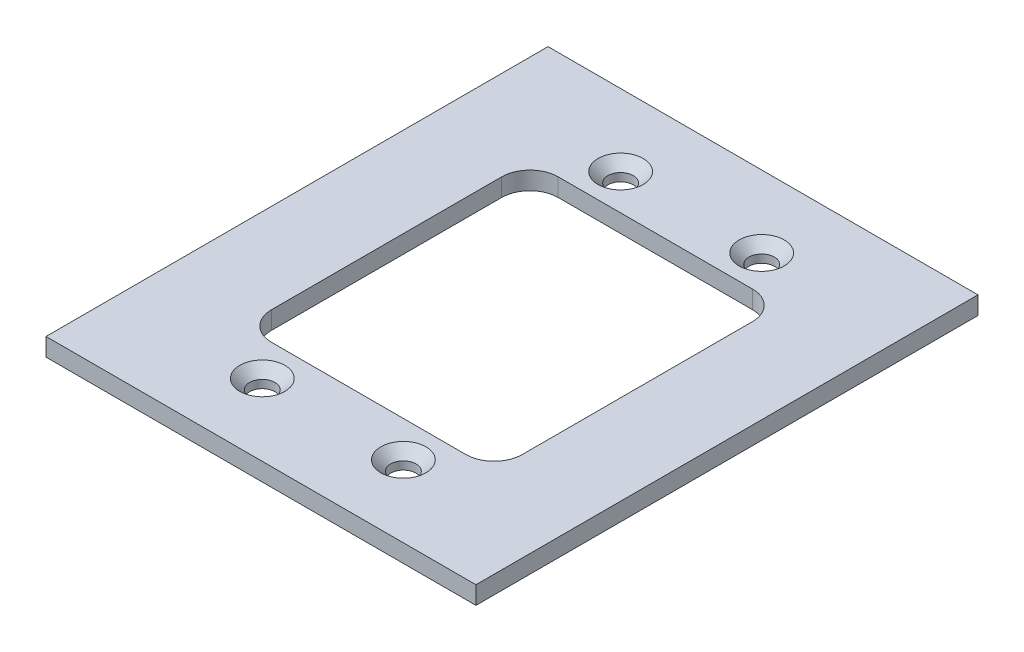
ISO-10303-21;
HEADER;
FILE_DESCRIPTION(('STEP AP214'),'2;1');
FILE_NAME('part.step','',(''),(''),'','','');
FILE_SCHEMA(('AUTOMOTIVE_DESIGN { 1 0 10303 214 1 1 1 1 }'));
ENDSEC;
DATA;
#1=APPLICATION_CONTEXT('core data for automotive mechanical design processes');
#2=APPLICATION_PROTOCOL_DEFINITION('international standard','automotive_design',2000,#1);
#3=PRODUCT_CONTEXT('',#1,'mechanical');
#4=PRODUCT('Part','Part','',(#3));
#5=PRODUCT_RELATED_PRODUCT_CATEGORY('part','',(#4));
#6=PRODUCT_DEFINITION_FORMATION('','',#4);
#7=PRODUCT_DEFINITION_CONTEXT('part definition',#1,'design');
#8=PRODUCT_DEFINITION('design','',#6,#7);
#9=PRODUCT_DEFINITION_SHAPE('','',#8);
#10=(LENGTH_UNIT() NAMED_UNIT(*) SI_UNIT(.MILLI.,.METRE.));
#11=(NAMED_UNIT(*) PLANE_ANGLE_UNIT() SI_UNIT($,.RADIAN.));
#12=(NAMED_UNIT(*) SI_UNIT($,.STERADIAN.) SOLID_ANGLE_UNIT());
#13=UNCERTAINTY_MEASURE_WITH_UNIT(LENGTH_MEASURE(1.E-05),#10,'distance_accuracy_value','');
#14=(GEOMETRIC_REPRESENTATION_CONTEXT(3) GLOBAL_UNCERTAINTY_ASSIGNED_CONTEXT((#13)) GLOBAL_UNIT_ASSIGNED_CONTEXT((#10,
#11,#12)) REPRESENTATION_CONTEXT('',''));
#15=CARTESIAN_POINT('',(0.,0.,0.));
#16=DIRECTION('',(0.,0.,1.));
#17=DIRECTION('',(1.,0.,0.));
#18=AXIS2_PLACEMENT_3D('',#15,#16,#17);
#19=CARTESIAN_POINT('',(0.,3.175,0.));
#20=DIRECTION('',(0.,1.,0.));
#21=DIRECTION('',(0.,0.,1.));
#22=AXIS2_PLACEMENT_3D('',#19,#20,#21);
#23=PLANE('',#22);
#24=CARTESIAN_POINT('',(-12.5,3.175,31.75));
#25=DIRECTION('',(0.,1.,0.));
#26=DIRECTION('',(0.,0.,1.));
#27=AXIS2_PLACEMENT_3D('',#24,#25,#26);
#28=CIRCLE('',#27,4.);
#29=CARTESIAN_POINT('',(-12.5,3.175,35.75));
#30=VERTEX_POINT('',#29);
#31=EDGE_CURVE('E318',#30,#30,#28,.T.);
#32=ORIENTED_EDGE('',*,*,#31,.F.);
#33=EDGE_LOOP('',(#32));
#34=FACE_BOUND('',#33,.T.);
#35=CARTESIAN_POINT('',(12.5,3.175,31.75));
#36=DIRECTION('',(0.,1.,0.));
#37=DIRECTION('',(0.,0.,1.));
#38=AXIS2_PLACEMENT_3D('',#35,#36,#37);
#39=CIRCLE('',#38,4.);
#40=CARTESIAN_POINT('',(12.5,3.175,35.75));
#41=VERTEX_POINT('',#40);
#42=EDGE_CURVE('E330',#41,#41,#39,.T.);
#43=ORIENTED_EDGE('',*,*,#42,.F.);
#44=EDGE_LOOP('',(#43));
#45=FACE_BOUND('',#44,.T.);
#46=CARTESIAN_POINT('',(-12.5,3.175,-31.75));
#47=DIRECTION('',(0.,1.,0.));
#48=DIRECTION('',(0.,0.,1.));
#49=AXIS2_PLACEMENT_3D('',#46,#47,#48);
#50=CIRCLE('',#49,4.);
#51=CARTESIAN_POINT('',(-12.5,3.175,-27.75));
#52=VERTEX_POINT('',#51);
#53=EDGE_CURVE('E339',#52,#52,#50,.T.);
#54=ORIENTED_EDGE('',*,*,#53,.F.);
#55=EDGE_LOOP('',(#54));
#56=FACE_BOUND('',#55,.T.);
#57=CARTESIAN_POINT('',(12.5,3.175,-31.75));
#58=DIRECTION('',(0.,1.,0.));
#59=DIRECTION('',(0.,0.,1.));
#60=AXIS2_PLACEMENT_3D('',#57,#58,#59);
#61=CIRCLE('',#60,4.);
#62=CARTESIAN_POINT('',(12.5,3.175,-27.75));
#63=VERTEX_POINT('',#62);
#64=EDGE_CURVE('E220',#63,#63,#61,.T.);
#65=ORIENTED_EDGE('',*,*,#64,.F.);
#66=EDGE_LOOP('',(#65));
#67=FACE_BOUND('',#66,.T.);
#68=DIRECTION('',(0.,0.,1.));
#69=VECTOR('',#68,1.);
#70=CARTESIAN_POINT('',(-38.1,3.175,-44.489));
#71=LINE('',#70,#69);
#72=CARTESIAN_POINT('',(-38.1,3.175,-44.489));
#73=VERTEX_POINT('',#72);
#74=CARTESIAN_POINT('',(-38.1,3.175,44.489));
#75=VERTEX_POINT('',#74);
#76=EDGE_CURVE('E139',#73,#75,#71,.T.);
#77=ORIENTED_EDGE('',*,*,#76,.T.);
#78=DIRECTION('',(1.,0.,0.));
#79=VECTOR('',#78,1.);
#80=CARTESIAN_POINT('',(-38.1,3.175,44.489));
#81=LINE('',#80,#79);
#82=CARTESIAN_POINT('',(38.1,3.175,44.489));
#83=VERTEX_POINT('',#82);
#84=EDGE_CURVE('E128',#75,#83,#81,.T.);
#85=ORIENTED_EDGE('',*,*,#84,.T.);
#86=DIRECTION('',(0.,0.,-1.));
#87=VECTOR('',#86,1.);
#88=CARTESIAN_POINT('',(38.1,3.175,-44.489));
#89=LINE('',#88,#87);
#90=CARTESIAN_POINT('',(38.1,3.175,-44.489));
#91=VERTEX_POINT('',#90);
#92=EDGE_CURVE('E138',#83,#91,#89,.T.);
#93=ORIENTED_EDGE('',*,*,#92,.T.);
#94=DIRECTION('',(-1.,0.,0.));
#95=VECTOR('',#94,1.);
#96=CARTESIAN_POINT('',(-38.1,3.175,-44.489));
#97=LINE('',#96,#95);
#98=EDGE_CURVE('E143',#91,#73,#97,.T.);
#99=ORIENTED_EDGE('',*,*,#98,.T.);
#100=EDGE_LOOP('',(#77,#85,#93,#99));
#101=FACE_BOUND('',#100,.T.);
#102=DIRECTION('',(1.,0.,0.));
#103=VECTOR('',#102,1.);
#104=CARTESIAN_POINT('',(-22.225,3.175,25.4));
#105=LINE('',#104,#103);
#106=CARTESIAN_POINT('',(-17.225,3.175,25.4));
#107=VERTEX_POINT('',#106);
#108=CARTESIAN_POINT('',(17.225,3.175,25.4));
#109=VERTEX_POINT('',#108);
#110=EDGE_CURVE('E209',#107,#109,#105,.T.);
#111=ORIENTED_EDGE('',*,*,#110,.F.);
#112=CARTESIAN_POINT('',(-17.225,3.175,20.4));
#113=DIRECTION('',(0.,1.,0.));
#114=DIRECTION('',(0.,0.,1.));
#115=AXIS2_PLACEMENT_3D('',#112,#113,#114);
#116=CIRCLE('',#115,5.);
#117=CARTESIAN_POINT('',(-22.225,3.175,20.4));
#118=VERTEX_POINT('',#117);
#119=EDGE_CURVE('E178',#107,#118,#116,.F.);
#120=ORIENTED_EDGE('',*,*,#119,.T.);
#121=DIRECTION('',(0.,0.,1.));
#122=VECTOR('',#121,1.);
#123=CARTESIAN_POINT('',(-22.225,3.175,-25.4));
#124=LINE('',#123,#122);
#125=CARTESIAN_POINT('',(-22.225,3.175,-20.4));
#126=VERTEX_POINT('',#125);
#127=EDGE_CURVE('E197',#126,#118,#124,.T.);
#128=ORIENTED_EDGE('',*,*,#127,.F.);
#129=CARTESIAN_POINT('',(-17.225,3.175,-20.4));
#130=DIRECTION('',(0.,1.,0.));
#131=DIRECTION('',(0.,0.,1.));
#132=AXIS2_PLACEMENT_3D('',#129,#130,#131);
#133=CIRCLE('',#132,5.);
#134=CARTESIAN_POINT('',(-17.225,3.175,-25.4));
#135=VERTEX_POINT('',#134);
#136=EDGE_CURVE('E53',#126,#135,#133,.F.);
#137=ORIENTED_EDGE('',*,*,#136,.T.);
#138=DIRECTION('',(-1.,0.,0.));
#139=VECTOR('',#138,1.);
#140=CARTESIAN_POINT('',(-22.225,3.175,-25.4));
#141=LINE('',#140,#139);
#142=CARTESIAN_POINT('',(17.225,3.175,-25.4));
#143=VERTEX_POINT('',#142);
#144=EDGE_CURVE('E205',#143,#135,#141,.T.);
#145=ORIENTED_EDGE('',*,*,#144,.F.);
#146=CARTESIAN_POINT('',(17.225,3.175,-20.4));
#147=DIRECTION('',(0.,1.,0.));
#148=DIRECTION('',(0.,0.,1.));
#149=AXIS2_PLACEMENT_3D('',#146,#147,#148);
#150=CIRCLE('',#149,5.);
#151=CARTESIAN_POINT('',(22.225,3.175,-20.4));
#152=VERTEX_POINT('',#151);
#153=EDGE_CURVE('E11',#143,#152,#150,.F.);
#154=ORIENTED_EDGE('',*,*,#153,.T.);
#155=DIRECTION('',(0.,0.,-1.));
#156=VECTOR('',#155,1.);
#157=CARTESIAN_POINT('',(22.225,3.175,-25.4));
#158=LINE('',#157,#156);
#159=CARTESIAN_POINT('',(22.225,3.175,20.4));
#160=VERTEX_POINT('',#159);
#161=EDGE_CURVE('E203',#160,#152,#158,.T.);
#162=ORIENTED_EDGE('',*,*,#161,.F.);
#163=CARTESIAN_POINT('',(17.225,3.175,20.4));
#164=DIRECTION('',(0.,1.,0.));
#165=DIRECTION('',(0.,0.,1.));
#166=AXIS2_PLACEMENT_3D('',#163,#164,#165);
#167=CIRCLE('',#166,5.);
#168=EDGE_CURVE('E182',#160,#109,#167,.F.);
#169=ORIENTED_EDGE('',*,*,#168,.T.);
#170=EDGE_LOOP('',(#111,#120,#128,#137,#145,#154,#162,#169));
#171=FACE_BOUND('',#170,.T.);
#172=ADVANCED_FACE('F38',(#34,#45,#56,#67,#101,#171),#23,.T.);
#173=CARTESIAN_POINT('',(0.,0.,0.));
#174=DIRECTION('',(0.,1.,0.));
#175=DIRECTION('',(0.,0.,1.));
#176=AXIS2_PLACEMENT_3D('',#173,#174,#175);
#177=PLANE('',#176);
#178=CARTESIAN_POINT('',(-12.5,0.,31.75));
#179=DIRECTION('',(0.,1.,0.));
#180=DIRECTION('',(0.,0.,1.));
#181=AXIS2_PLACEMENT_3D('',#178,#179,#180);
#182=CIRCLE('',#181,2.25);
#183=CARTESIAN_POINT('',(-12.5,0.,34.));
#184=VERTEX_POINT('',#183);
#185=EDGE_CURVE('E314',#184,#184,#182,.T.);
#186=ORIENTED_EDGE('',*,*,#185,.T.);
#187=EDGE_LOOP('',(#186));
#188=FACE_BOUND('',#187,.T.);
#189=CARTESIAN_POINT('',(12.5,0.,31.75));
#190=DIRECTION('',(0.,1.,0.));
#191=DIRECTION('',(0.,0.,1.));
#192=AXIS2_PLACEMENT_3D('',#189,#190,#191);
#193=CIRCLE('',#192,2.25);
#194=CARTESIAN_POINT('',(12.5,0.,34.));
#195=VERTEX_POINT('',#194);
#196=EDGE_CURVE('E321',#195,#195,#193,.T.);
#197=ORIENTED_EDGE('',*,*,#196,.T.);
#198=EDGE_LOOP('',(#197));
#199=FACE_BOUND('',#198,.T.);
#200=CARTESIAN_POINT('',(-12.5,0.,-31.75));
#201=DIRECTION('',(0.,1.,0.));
#202=DIRECTION('',(0.,0.,1.));
#203=AXIS2_PLACEMENT_3D('',#200,#201,#202);
#204=CIRCLE('',#203,2.25);
#205=CARTESIAN_POINT('',(-12.5,0.,-29.5));
#206=VERTEX_POINT('',#205);
#207=EDGE_CURVE('E333',#206,#206,#204,.T.);
#208=ORIENTED_EDGE('',*,*,#207,.T.);
#209=EDGE_LOOP('',(#208));
#210=FACE_BOUND('',#209,.T.);
#211=CARTESIAN_POINT('',(12.5,0.,-31.75));
#212=DIRECTION('',(0.,1.,0.));
#213=DIRECTION('',(0.,0.,1.));
#214=AXIS2_PLACEMENT_3D('',#211,#212,#213);
#215=CIRCLE('',#214,2.25);
#216=CARTESIAN_POINT('',(12.5,0.,-29.5));
#217=VERTEX_POINT('',#216);
#218=EDGE_CURVE('E342',#217,#217,#215,.T.);
#219=ORIENTED_EDGE('',*,*,#218,.T.);
#220=EDGE_LOOP('',(#219));
#221=FACE_BOUND('',#220,.T.);
#222=DIRECTION('',(0.,0.,1.));
#223=VECTOR('',#222,1.);
#224=CARTESIAN_POINT('',(-38.1,0.,-44.489));
#225=LINE('',#224,#223);
#226=CARTESIAN_POINT('',(-38.1,0.,-44.489));
#227=VERTEX_POINT('',#226);
#228=CARTESIAN_POINT('',(-38.1,0.,44.489));
#229=VERTEX_POINT('',#228);
#230=EDGE_CURVE('E151',#227,#229,#225,.T.);
#231=ORIENTED_EDGE('',*,*,#230,.F.);
#232=DIRECTION('',(-1.,0.,0.));
#233=VECTOR('',#232,1.);
#234=CARTESIAN_POINT('',(-38.1,0.,-44.489));
#235=LINE('',#234,#233);
#236=CARTESIAN_POINT('',(38.1,0.,-44.489));
#237=VERTEX_POINT('',#236);
#238=EDGE_CURVE('E147',#237,#227,#235,.T.);
#239=ORIENTED_EDGE('',*,*,#238,.F.);
#240=DIRECTION('',(0.,0.,-1.));
#241=VECTOR('',#240,1.);
#242=CARTESIAN_POINT('',(38.1,0.,-44.489));
#243=LINE('',#242,#241);
#244=CARTESIAN_POINT('',(38.1,0.,44.489));
#245=VERTEX_POINT('',#244);
#246=EDGE_CURVE('E230',#245,#237,#243,.T.);
#247=ORIENTED_EDGE('',*,*,#246,.F.);
#248=DIRECTION('',(1.,0.,0.));
#249=VECTOR('',#248,1.);
#250=CARTESIAN_POINT('',(-38.1,0.,44.489));
#251=LINE('',#250,#249);
#252=EDGE_CURVE('E228',#229,#245,#251,.T.);
#253=ORIENTED_EDGE('',*,*,#252,.F.);
#254=EDGE_LOOP('',(#231,#239,#247,#253));
#255=FACE_BOUND('',#254,.T.);
#256=DIRECTION('',(-1.,0.,0.));
#257=VECTOR('',#256,1.);
#258=CARTESIAN_POINT('',(-22.225,0.,-25.4));
#259=LINE('',#258,#257);
#260=CARTESIAN_POINT('',(17.225,0.,-25.4));
#261=VERTEX_POINT('',#260);
#262=CARTESIAN_POINT('',(-17.225,0.,-25.4));
#263=VERTEX_POINT('',#262);
#264=EDGE_CURVE('E190',#261,#263,#259,.T.);
#265=ORIENTED_EDGE('',*,*,#264,.T.);
#266=CARTESIAN_POINT('',(-17.225,0.,-20.4));
#267=DIRECTION('',(0.,1.,0.));
#268=DIRECTION('',(0.,0.,1.));
#269=AXIS2_PLACEMENT_3D('',#266,#267,#268);
#270=CIRCLE('',#269,5.);
#271=CARTESIAN_POINT('',(-22.225,0.,-20.4));
#272=VERTEX_POINT('',#271);
#273=EDGE_CURVE('E184',#263,#272,#270,.T.);
#274=ORIENTED_EDGE('',*,*,#273,.T.);
#275=DIRECTION('',(0.,0.,1.));
#276=VECTOR('',#275,1.);
#277=CARTESIAN_POINT('',(-22.225,0.,-25.4));
#278=LINE('',#277,#276);
#279=CARTESIAN_POINT('',(-22.225,0.,20.4));
#280=VERTEX_POINT('',#279);
#281=EDGE_CURVE('E216',#272,#280,#278,.T.);
#282=ORIENTED_EDGE('',*,*,#281,.T.);
#283=CARTESIAN_POINT('',(-17.225,0.,20.4));
#284=DIRECTION('',(0.,1.,0.));
#285=DIRECTION('',(0.,0.,1.));
#286=AXIS2_PLACEMENT_3D('',#283,#284,#285);
#287=CIRCLE('',#286,5.);
#288=CARTESIAN_POINT('',(-17.225,0.,25.4));
#289=VERTEX_POINT('',#288);
#290=EDGE_CURVE('E176',#280,#289,#287,.T.);
#291=ORIENTED_EDGE('',*,*,#290,.T.);
#292=DIRECTION('',(1.,0.,0.));
#293=VECTOR('',#292,1.);
#294=CARTESIAN_POINT('',(-22.225,0.,25.4));
#295=LINE('',#294,#293);
#296=CARTESIAN_POINT('',(17.225,0.,25.4));
#297=VERTEX_POINT('',#296);
#298=EDGE_CURVE('E219',#289,#297,#295,.T.);
#299=ORIENTED_EDGE('',*,*,#298,.T.);
#300=CARTESIAN_POINT('',(17.225,0.,20.4));
#301=DIRECTION('',(0.,1.,0.));
#302=DIRECTION('',(0.,0.,1.));
#303=AXIS2_PLACEMENT_3D('',#300,#301,#302);
#304=CIRCLE('',#303,5.);
#305=CARTESIAN_POINT('',(22.225,0.,20.4));
#306=VERTEX_POINT('',#305);
#307=EDGE_CURVE('E180',#297,#306,#304,.T.);
#308=ORIENTED_EDGE('',*,*,#307,.T.);
#309=DIRECTION('',(0.,0.,-1.));
#310=VECTOR('',#309,1.);
#311=CARTESIAN_POINT('',(22.225,0.,-25.4));
#312=LINE('',#311,#310);
#313=CARTESIAN_POINT('',(22.225,0.,-20.4));
#314=VERTEX_POINT('',#313);
#315=EDGE_CURVE('E192',#306,#314,#312,.T.);
#316=ORIENTED_EDGE('',*,*,#315,.T.);
#317=CARTESIAN_POINT('',(17.225,0.,-20.4));
#318=DIRECTION('',(0.,1.,0.));
#319=DIRECTION('',(0.,0.,1.));
#320=AXIS2_PLACEMENT_3D('',#317,#318,#319);
#321=CIRCLE('',#320,5.);
#322=EDGE_CURVE('E46',#314,#261,#321,.T.);
#323=ORIENTED_EDGE('',*,*,#322,.T.);
#324=EDGE_LOOP('',(#265,#274,#282,#291,#299,#308,#316,#323));
#325=FACE_BOUND('',#324,.T.);
#326=ADVANCED_FACE('F189',(#188,#199,#210,#221,#255,#325),#177,.F.);
#327=CARTESIAN_POINT('',(-38.1,3.175,-44.489));
#328=DIRECTION('',(1.,0.,0.));
#329=DIRECTION('',(0.,0.,-1.));
#330=AXIS2_PLACEMENT_3D('',#327,#328,#329);
#331=PLANE('',#330);
#332=ORIENTED_EDGE('',*,*,#230,.T.);
#333=DIRECTION('',(0.,-1.,0.));
#334=VECTOR('',#333,1.);
#335=CARTESIAN_POINT('',(-38.1,3.175,44.489));
#336=LINE('',#335,#334);
#337=EDGE_CURVE('E132',#75,#229,#336,.T.);
#338=ORIENTED_EDGE('',*,*,#337,.F.);
#339=ORIENTED_EDGE('',*,*,#76,.F.);
#340=DIRECTION('',(0.,-1.,0.));
#341=VECTOR('',#340,1.);
#342=CARTESIAN_POINT('',(-38.1,3.175,-44.489));
#343=LINE('',#342,#341);
#344=EDGE_CURVE('E226',#73,#227,#343,.T.);
#345=ORIENTED_EDGE('',*,*,#344,.T.);
#346=EDGE_LOOP('',(#332,#338,#339,#345));
#347=FACE_BOUND('',#346,.T.);
#348=ADVANCED_FACE('F149',(#347),#331,.F.);
#349=CARTESIAN_POINT('',(-38.1,3.175,44.489));
#350=DIRECTION('',(0.,0.,-1.));
#351=DIRECTION('',(-1.,0.,0.));
#352=AXIS2_PLACEMENT_3D('',#349,#350,#351);
#353=PLANE('',#352);
#354=ORIENTED_EDGE('',*,*,#252,.T.);
#355=DIRECTION('',(0.,-1.,0.));
#356=VECTOR('',#355,1.);
#357=CARTESIAN_POINT('',(38.1,3.175,44.489));
#358=LINE('',#357,#356);
#359=EDGE_CURVE('E135',#83,#245,#358,.T.);
#360=ORIENTED_EDGE('',*,*,#359,.F.);
#361=ORIENTED_EDGE('',*,*,#84,.F.);
#362=ORIENTED_EDGE('',*,*,#337,.T.);
#363=EDGE_LOOP('',(#354,#360,#361,#362));
#364=FACE_BOUND('',#363,.T.);
#365=ADVANCED_FACE('F130',(#364),#353,.F.);
#366=CARTESIAN_POINT('',(38.1,3.175,-44.489));
#367=DIRECTION('',(-1.,0.,0.));
#368=DIRECTION('',(0.,0.,1.));
#369=AXIS2_PLACEMENT_3D('',#366,#367,#368);
#370=PLANE('',#369);
#371=ORIENTED_EDGE('',*,*,#246,.T.);
#372=DIRECTION('',(0.,-1.,0.));
#373=VECTOR('',#372,1.);
#374=CARTESIAN_POINT('',(38.1,3.175,-44.489));
#375=LINE('',#374,#373);
#376=EDGE_CURVE('E156',#91,#237,#375,.T.);
#377=ORIENTED_EDGE('',*,*,#376,.F.);
#378=ORIENTED_EDGE('',*,*,#92,.F.);
#379=ORIENTED_EDGE('',*,*,#359,.T.);
#380=EDGE_LOOP('',(#371,#377,#378,#379));
#381=FACE_BOUND('',#380,.T.);
#382=ADVANCED_FACE('F241',(#381),#370,.F.);
#383=CARTESIAN_POINT('',(-38.1,3.175,-44.489));
#384=DIRECTION('',(0.,0.,1.));
#385=DIRECTION('',(1.,0.,0.));
#386=AXIS2_PLACEMENT_3D('',#383,#384,#385);
#387=PLANE('',#386);
#388=ORIENTED_EDGE('',*,*,#238,.T.);
#389=ORIENTED_EDGE('',*,*,#344,.F.);
#390=ORIENTED_EDGE('',*,*,#98,.F.);
#391=ORIENTED_EDGE('',*,*,#376,.T.);
#392=EDGE_LOOP('',(#388,#389,#390,#391));
#393=FACE_BOUND('',#392,.T.);
#394=ADVANCED_FACE('F237',(#393),#387,.F.);
#395=CARTESIAN_POINT('',(-22.225,3.175,-25.4));
#396=DIRECTION('',(1.,0.,0.));
#397=DIRECTION('',(0.,0.,-1.));
#398=AXIS2_PLACEMENT_3D('',#395,#396,#397);
#399=PLANE('',#398);
#400=ORIENTED_EDGE('',*,*,#127,.T.);
#401=DIRECTION('',(0.,-1.,0.));
#402=VECTOR('',#401,1.);
#403=CARTESIAN_POINT('',(-22.225,0.,20.4));
#404=LINE('',#403,#402);
#405=EDGE_CURVE('E154',#118,#280,#404,.T.);
#406=ORIENTED_EDGE('',*,*,#405,.T.);
#407=ORIENTED_EDGE('',*,*,#281,.F.);
#408=DIRECTION('',(0.,-1.,0.));
#409=VECTOR('',#408,1.);
#410=CARTESIAN_POINT('',(-22.225,3.175,-20.4));
#411=LINE('',#410,#409);
#412=EDGE_CURVE('E152',#272,#126,#411,.F.);
#413=ORIENTED_EDGE('',*,*,#412,.T.);
#414=EDGE_LOOP('',(#400,#406,#407,#413));
#415=FACE_BOUND('',#414,.T.);
#416=ADVANCED_FACE('F248',(#415),#399,.T.);
#417=CARTESIAN_POINT('',(-22.225,3.175,25.4));
#418=DIRECTION('',(0.,0.,-1.));
#419=DIRECTION('',(-1.,0.,0.));
#420=AXIS2_PLACEMENT_3D('',#417,#418,#419);
#421=PLANE('',#420);
#422=ORIENTED_EDGE('',*,*,#298,.F.);
#423=DIRECTION('',(0.,-1.,0.));
#424=VECTOR('',#423,1.);
#425=CARTESIAN_POINT('',(-17.225,3.175,25.4));
#426=LINE('',#425,#424);
#427=EDGE_CURVE('E165',#289,#107,#426,.F.);
#428=ORIENTED_EDGE('',*,*,#427,.T.);
#429=ORIENTED_EDGE('',*,*,#110,.T.);
#430=DIRECTION('',(0.,-1.,0.));
#431=VECTOR('',#430,1.);
#432=CARTESIAN_POINT('',(17.225,0.,25.4));
#433=LINE('',#432,#431);
#434=EDGE_CURVE('E162',#109,#297,#433,.T.);
#435=ORIENTED_EDGE('',*,*,#434,.T.);
#436=EDGE_LOOP('',(#422,#428,#429,#435));
#437=FACE_BOUND('',#436,.T.);
#438=ADVANCED_FACE('F264',(#437),#421,.T.);
#439=CARTESIAN_POINT('',(22.225,3.175,-25.4));
#440=DIRECTION('',(-1.,0.,0.));
#441=DIRECTION('',(0.,0.,1.));
#442=AXIS2_PLACEMENT_3D('',#439,#440,#441);
#443=PLANE('',#442);
#444=ORIENTED_EDGE('',*,*,#315,.F.);
#445=DIRECTION('',(0.,-1.,0.));
#446=VECTOR('',#445,1.);
#447=CARTESIAN_POINT('',(22.225,3.175,20.4));
#448=LINE('',#447,#446);
#449=EDGE_CURVE('E170',#306,#160,#448,.F.);
#450=ORIENTED_EDGE('',*,*,#449,.T.);
#451=ORIENTED_EDGE('',*,*,#161,.T.);
#452=DIRECTION('',(0.,-1.,0.));
#453=VECTOR('',#452,1.);
#454=CARTESIAN_POINT('',(22.225,0.,-20.4));
#455=LINE('',#454,#453);
#456=EDGE_CURVE('E167',#152,#314,#455,.T.);
#457=ORIENTED_EDGE('',*,*,#456,.T.);
#458=EDGE_LOOP('',(#444,#450,#451,#457));
#459=FACE_BOUND('',#458,.T.);
#460=ADVANCED_FACE('F207',(#459),#443,.T.);
#461=CARTESIAN_POINT('',(-22.225,3.175,-25.4));
#462=DIRECTION('',(0.,0.,1.));
#463=DIRECTION('',(1.,0.,0.));
#464=AXIS2_PLACEMENT_3D('',#461,#462,#463);
#465=PLANE('',#464);
#466=ORIENTED_EDGE('',*,*,#144,.T.);
#467=DIRECTION('',(0.,-1.,0.));
#468=VECTOR('',#467,1.);
#469=CARTESIAN_POINT('',(-17.225,0.,-25.4));
#470=LINE('',#469,#468);
#471=EDGE_CURVE('E173',#135,#263,#470,.T.);
#472=ORIENTED_EDGE('',*,*,#471,.T.);
#473=ORIENTED_EDGE('',*,*,#264,.F.);
#474=DIRECTION('',(0.,-1.,0.));
#475=VECTOR('',#474,1.);
#476=CARTESIAN_POINT('',(17.225,3.175,-25.4));
#477=LINE('',#476,#475);
#478=EDGE_CURVE('E60',#261,#143,#477,.F.);
#479=ORIENTED_EDGE('',*,*,#478,.T.);
#480=EDGE_LOOP('',(#466,#472,#473,#479));
#481=FACE_BOUND('',#480,.T.);
#482=ADVANCED_FACE('F195',(#481),#465,.T.);
#483=CARTESIAN_POINT('',(12.5,3.175,-31.75));
#484=DIRECTION('',(0.,1.,0.));
#485=DIRECTION('',(0.,0.,1.));
#486=AXIS2_PLACEMENT_3D('',#483,#484,#485);
#487=CONICAL_SURFACE('',#486,4.,0.785398163397448);
#488=CARTESIAN_POINT('',(12.5,1.425,-31.75));
#489=DIRECTION('',(0.,1.,0.));
#490=DIRECTION('',(0.,0.,1.));
#491=AXIS2_PLACEMENT_3D('',#488,#489,#490);
#492=CIRCLE('',#491,2.25);
#493=CARTESIAN_POINT('',(12.5,1.425,-29.5));
#494=VERTEX_POINT('',#493);
#495=EDGE_CURVE('E345',#494,#494,#492,.T.);
#496=ORIENTED_EDGE('',*,*,#495,.F.);
#497=EDGE_LOOP('',(#496));
#498=FACE_BOUND('',#497,.T.);
#499=ORIENTED_EDGE('',*,*,#64,.T.);
#500=EDGE_LOOP('',(#499));
#501=FACE_BOUND('',#500,.T.);
#502=ADVANCED_FACE('F273',(#498,#501),#487,.F.);
#503=CARTESIAN_POINT('',(12.5,3.175,-31.75));
#504=DIRECTION('',(0.,1.,0.));
#505=DIRECTION('',(0.,0.,1.));
#506=AXIS2_PLACEMENT_3D('',#503,#504,#505);
#507=CYLINDRICAL_SURFACE('',#506,2.25);
#508=ORIENTED_EDGE('',*,*,#218,.F.);
#509=EDGE_LOOP('',(#508));
#510=FACE_BOUND('',#509,.T.);
#511=ORIENTED_EDGE('',*,*,#495,.T.);
#512=EDGE_LOOP('',(#511));
#513=FACE_BOUND('',#512,.T.);
#514=ADVANCED_FACE('F276',(#510,#513),#507,.F.);
#515=CARTESIAN_POINT('',(-12.5,3.175,-31.75));
#516=DIRECTION('',(0.,1.,0.));
#517=DIRECTION('',(0.,0.,1.));
#518=AXIS2_PLACEMENT_3D('',#515,#516,#517);
#519=CONICAL_SURFACE('',#518,4.,0.785398163397448);
#520=CARTESIAN_POINT('',(-12.5,1.425,-31.75));
#521=DIRECTION('',(0.,1.,0.));
#522=DIRECTION('',(0.,0.,1.));
#523=AXIS2_PLACEMENT_3D('',#520,#521,#522);
#524=CIRCLE('',#523,2.25);
#525=CARTESIAN_POINT('',(-12.5,1.425,-29.5));
#526=VERTEX_POINT('',#525);
#527=EDGE_CURVE('E336',#526,#526,#524,.T.);
#528=ORIENTED_EDGE('',*,*,#527,.F.);
#529=EDGE_LOOP('',(#528));
#530=FACE_BOUND('',#529,.T.);
#531=ORIENTED_EDGE('',*,*,#53,.T.);
#532=EDGE_LOOP('',(#531));
#533=FACE_BOUND('',#532,.T.);
#534=ADVANCED_FACE('F280',(#530,#533),#519,.F.);
#535=CARTESIAN_POINT('',(-12.5,3.175,-31.75));
#536=DIRECTION('',(0.,1.,0.));
#537=DIRECTION('',(0.,0.,1.));
#538=AXIS2_PLACEMENT_3D('',#535,#536,#537);
#539=CYLINDRICAL_SURFACE('',#538,2.25);
#540=ORIENTED_EDGE('',*,*,#207,.F.);
#541=EDGE_LOOP('',(#540));
#542=FACE_BOUND('',#541,.T.);
#543=ORIENTED_EDGE('',*,*,#527,.T.);
#544=EDGE_LOOP('',(#543));
#545=FACE_BOUND('',#544,.T.);
#546=ADVANCED_FACE('F284',(#542,#545),#539,.F.);
#547=CARTESIAN_POINT('',(12.5,3.175,31.75));
#548=DIRECTION('',(0.,1.,0.));
#549=DIRECTION('',(0.,0.,1.));
#550=AXIS2_PLACEMENT_3D('',#547,#548,#549);
#551=CONICAL_SURFACE('',#550,4.,0.785398163397448);
#552=CARTESIAN_POINT('',(12.5,1.425,31.75));
#553=DIRECTION('',(0.,1.,0.));
#554=DIRECTION('',(0.,0.,1.));
#555=AXIS2_PLACEMENT_3D('',#552,#553,#554);
#556=CIRCLE('',#555,2.25);
#557=CARTESIAN_POINT('',(12.5,1.425,34.));
#558=VERTEX_POINT('',#557);
#559=EDGE_CURVE('E327',#558,#558,#556,.T.);
#560=ORIENTED_EDGE('',*,*,#559,.F.);
#561=EDGE_LOOP('',(#560));
#562=FACE_BOUND('',#561,.T.);
#563=ORIENTED_EDGE('',*,*,#42,.T.);
#564=EDGE_LOOP('',(#563));
#565=FACE_BOUND('',#564,.T.);
#566=ADVANCED_FACE('F288',(#562,#565),#551,.F.);
#567=CARTESIAN_POINT('',(12.5,3.175,31.75));
#568=DIRECTION('',(0.,1.,0.));
#569=DIRECTION('',(0.,0.,1.));
#570=AXIS2_PLACEMENT_3D('',#567,#568,#569);
#571=CYLINDRICAL_SURFACE('',#570,2.25);
#572=ORIENTED_EDGE('',*,*,#196,.F.);
#573=EDGE_LOOP('',(#572));
#574=FACE_BOUND('',#573,.T.);
#575=ORIENTED_EDGE('',*,*,#559,.T.);
#576=EDGE_LOOP('',(#575));
#577=FACE_BOUND('',#576,.T.);
#578=ADVANCED_FACE('F292',(#574,#577),#571,.F.);
#579=CARTESIAN_POINT('',(-12.5,3.175,31.75));
#580=DIRECTION('',(0.,1.,0.));
#581=DIRECTION('',(0.,0.,1.));
#582=AXIS2_PLACEMENT_3D('',#579,#580,#581);
#583=CONICAL_SURFACE('',#582,4.,0.785398163397448);
#584=CARTESIAN_POINT('',(-12.5,1.425,31.75));
#585=DIRECTION('',(0.,1.,0.));
#586=DIRECTION('',(0.,0.,1.));
#587=AXIS2_PLACEMENT_3D('',#584,#585,#586);
#588=CIRCLE('',#587,2.25);
#589=CARTESIAN_POINT('',(-12.5,1.425,34.));
#590=VERTEX_POINT('',#589);
#591=EDGE_CURVE('E317',#590,#590,#588,.T.);
#592=ORIENTED_EDGE('',*,*,#591,.F.);
#593=EDGE_LOOP('',(#592));
#594=FACE_BOUND('',#593,.T.);
#595=ORIENTED_EDGE('',*,*,#31,.T.);
#596=EDGE_LOOP('',(#595));
#597=FACE_BOUND('',#596,.T.);
#598=ADVANCED_FACE('F296',(#594,#597),#583,.F.);
#599=CARTESIAN_POINT('',(-12.5,3.175,31.75));
#600=DIRECTION('',(0.,1.,0.));
#601=DIRECTION('',(0.,0.,1.));
#602=AXIS2_PLACEMENT_3D('',#599,#600,#601);
#603=CYLINDRICAL_SURFACE('',#602,2.25);
#604=ORIENTED_EDGE('',*,*,#185,.F.);
#605=EDGE_LOOP('',(#604));
#606=FACE_BOUND('',#605,.T.);
#607=ORIENTED_EDGE('',*,*,#591,.T.);
#608=EDGE_LOOP('',(#607));
#609=FACE_BOUND('',#608,.T.);
#610=ADVANCED_FACE('F300',(#606,#609),#603,.F.);
#611=CARTESIAN_POINT('',(-17.225,3.175,20.4));
#612=DIRECTION('',(0.,1.,0.));
#613=DIRECTION('',(0.,0.,1.));
#614=AXIS2_PLACEMENT_3D('',#611,#612,#613);
#615=CYLINDRICAL_SURFACE('',#614,5.);
#616=ORIENTED_EDGE('',*,*,#119,.F.);
#617=ORIENTED_EDGE('',*,*,#427,.F.);
#618=ORIENTED_EDGE('',*,*,#290,.F.);
#619=ORIENTED_EDGE('',*,*,#405,.F.);
#620=EDGE_LOOP('',(#616,#617,#618,#619));
#621=FACE_BOUND('',#620,.T.);
#622=ADVANCED_FACE('F303',(#621),#615,.F.);
#623=CARTESIAN_POINT('',(17.225,3.175,20.4));
#624=DIRECTION('',(0.,1.,0.));
#625=DIRECTION('',(0.,0.,1.));
#626=AXIS2_PLACEMENT_3D('',#623,#624,#625);
#627=CYLINDRICAL_SURFACE('',#626,5.);
#628=ORIENTED_EDGE('',*,*,#168,.F.);
#629=ORIENTED_EDGE('',*,*,#449,.F.);
#630=ORIENTED_EDGE('',*,*,#307,.F.);
#631=ORIENTED_EDGE('',*,*,#434,.F.);
#632=EDGE_LOOP('',(#628,#629,#630,#631));
#633=FACE_BOUND('',#632,.T.);
#634=ADVANCED_FACE('F308',(#633),#627,.F.);
#635=CARTESIAN_POINT('',(-17.225,3.175,-20.4));
#636=DIRECTION('',(0.,1.,0.));
#637=DIRECTION('',(0.,0.,1.));
#638=AXIS2_PLACEMENT_3D('',#635,#636,#637);
#639=CYLINDRICAL_SURFACE('',#638,5.);
#640=ORIENTED_EDGE('',*,*,#136,.F.);
#641=ORIENTED_EDGE('',*,*,#412,.F.);
#642=ORIENTED_EDGE('',*,*,#273,.F.);
#643=ORIENTED_EDGE('',*,*,#471,.F.);
#644=EDGE_LOOP('',(#640,#641,#642,#643));
#645=FACE_BOUND('',#644,.T.);
#646=ADVANCED_FACE('F359',(#645),#639,.F.);
#647=CARTESIAN_POINT('',(17.225,3.175,-20.4));
#648=DIRECTION('',(0.,1.,0.));
#649=DIRECTION('',(0.,0.,1.));
#650=AXIS2_PLACEMENT_3D('',#647,#648,#649);
#651=CYLINDRICAL_SURFACE('',#650,5.);
#652=ORIENTED_EDGE('',*,*,#153,.F.);
#653=ORIENTED_EDGE('',*,*,#478,.F.);
#654=ORIENTED_EDGE('',*,*,#322,.F.);
#655=ORIENTED_EDGE('',*,*,#456,.F.);
#656=EDGE_LOOP('',(#652,#653,#654,#655));
#657=FACE_BOUND('',#656,.T.);
#658=ADVANCED_FACE('F40',(#657),#651,.F.);
#659=CLOSED_SHELL('',(#172,#326,#348,#365,#382,#394,#416,#438,#460,#482,#502,#514,#534,#546,
#566,#578,#598,#610,#622,#634,#646,#658));
#660=MANIFOLD_SOLID_BREP('B2',#659);
#661=ADVANCED_BREP_SHAPE_REPRESENTATION('',(#18,#660),#14);
#662=SHAPE_DEFINITION_REPRESENTATION(#9,#661);
ENDSEC;
END-ISO-10303-21;
